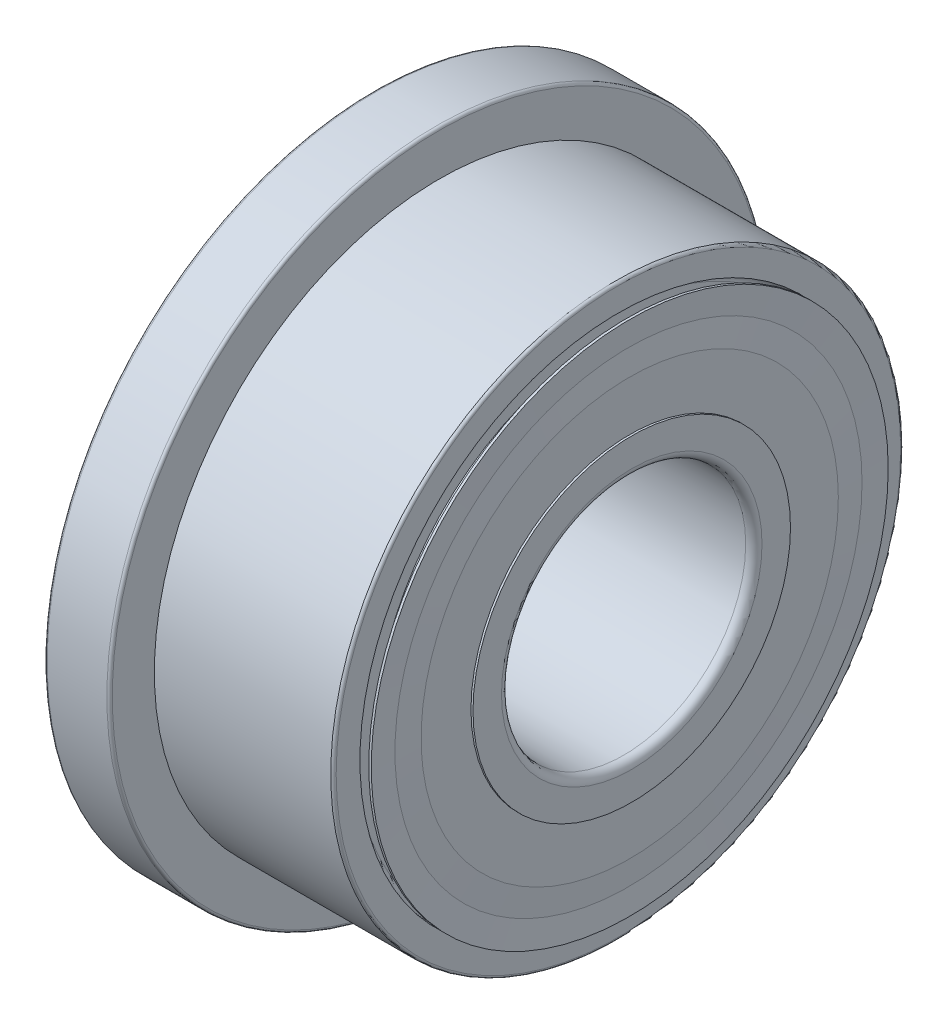
ISO-10303-21;
HEADER;
FILE_DESCRIPTION(('STEP AP214'),'2;1');
FILE_NAME('part.step','',(''),(''),'','','');
FILE_SCHEMA(('AUTOMOTIVE_DESIGN { 1 0 10303 214 1 1 1 1 }'));
ENDSEC;
DATA;
#1=APPLICATION_CONTEXT('core data for automotive mechanical design processes');
#2=APPLICATION_PROTOCOL_DEFINITION('international standard','automotive_design',2000,#1);
#3=PRODUCT_CONTEXT('',#1,'mechanical');
#4=PRODUCT('Part','Part','',(#3));
#5=PRODUCT_RELATED_PRODUCT_CATEGORY('part','',(#4));
#6=PRODUCT_DEFINITION_FORMATION('','',#4);
#7=PRODUCT_DEFINITION_CONTEXT('part definition',#1,'design');
#8=PRODUCT_DEFINITION('design','',#6,#7);
#9=PRODUCT_DEFINITION_SHAPE('','',#8);
#10=(LENGTH_UNIT() NAMED_UNIT(*) SI_UNIT(.MILLI.,.METRE.));
#11=(NAMED_UNIT(*) PLANE_ANGLE_UNIT() SI_UNIT($,.RADIAN.));
#12=(NAMED_UNIT(*) SI_UNIT($,.STERADIAN.) SOLID_ANGLE_UNIT());
#13=UNCERTAINTY_MEASURE_WITH_UNIT(LENGTH_MEASURE(1.E-05),#10,'distance_accuracy_value','');
#14=(GEOMETRIC_REPRESENTATION_CONTEXT(3) GLOBAL_UNCERTAINTY_ASSIGNED_CONTEXT((#13)) GLOBAL_UNIT_ASSIGNED_CONTEXT((#10,
#11,#12)) REPRESENTATION_CONTEXT('',''));
#15=CARTESIAN_POINT('',(0.,0.,0.));
#16=DIRECTION('',(0.,0.,1.));
#17=DIRECTION('',(1.,0.,0.));
#18=AXIS2_PLACEMENT_3D('',#15,#16,#17);
#19=CARTESIAN_POINT('',(2.36699999999871,0.,0.));
#20=DIRECTION('',(1.,0.,0.));
#21=DIRECTION('',(0.,0.,-1.));
#22=AXIS2_PLACEMENT_3D('',#19,#20,#21);
#23=CONICAL_SURFACE('',#22,1.905,1.4731486901);
#24=CARTESIAN_POINT('',(2.36699999999871,0.,0.));
#25=DIRECTION('',(1.,0.,0.));
#26=DIRECTION('',(0.,0.,-1.));
#27=AXIS2_PLACEMENT_3D('',#24,#25,#26);
#28=CIRCLE('',#27,1.905);
#29=CARTESIAN_POINT('',(2.36699999999871,0.,-1.905));
#30=VERTEX_POINT('',#29);
#31=EDGE_CURVE('E63',#30,#30,#28,.T.);
#32=ORIENTED_EDGE('',*,*,#31,.F.);
#33=EDGE_LOOP('',(#32));
#34=FACE_BOUND('',#33,.T.);
#35=CARTESIAN_POINT('',(2.34899999999872,0.,0.));
#36=DIRECTION('',(1.,0.,0.));
#37=DIRECTION('',(0.,0.,-1.));
#38=AXIS2_PLACEMENT_3D('',#35,#36,#37);
#39=CIRCLE('',#38,1.72125);
#40=CARTESIAN_POINT('',(2.34899999999872,0.,-1.72125));
#41=VERTEX_POINT('',#40);
#42=EDGE_CURVE('E12',#41,#41,#39,.T.);
#43=ORIENTED_EDGE('',*,*,#42,.T.);
#44=EDGE_LOOP('',(#43));
#45=FACE_BOUND('',#44,.T.);
#46=ADVANCED_FACE('F48',(#34,#45),#23,.T.);
#47=CARTESIAN_POINT('',(2.34899999999872,1.72125,0.));
#48=DIRECTION('',(-1.,0.,0.));
#49=DIRECTION('',(0.,0.,1.));
#50=AXIS2_PLACEMENT_3D('',#47,#48,#49);
#51=PLANE('',#50);
#52=ORIENTED_EDGE('',*,*,#42,.F.);
#53=EDGE_LOOP('',(#52));
#54=FACE_BOUND('',#53,.T.);
#55=CARTESIAN_POINT('',(2.34899999999872,0.,0.));
#56=DIRECTION('',(1.,0.,0.));
#57=DIRECTION('',(0.,0.,-1.));
#58=AXIS2_PLACEMENT_3D('',#55,#56,#57);
#59=CIRCLE('',#58,1.5375);
#60=CARTESIAN_POINT('',(2.34899999999872,0.,-1.5375));
#61=VERTEX_POINT('',#60);
#62=EDGE_CURVE('E57',#61,#61,#59,.T.);
#63=ORIENTED_EDGE('',*,*,#62,.T.);
#64=EDGE_LOOP('',(#63));
#65=FACE_BOUND('',#64,.T.);
#66=ADVANCED_FACE('F240',(#54,#65),#51,.T.);
#67=CARTESIAN_POINT('',(2.34899999999872,0.,0.));
#68=DIRECTION('',(-1.,0.,0.));
#69=DIRECTION('',(0.,0.,1.));
#70=AXIS2_PLACEMENT_3D('',#67,#68,#69);
#71=CONICAL_SURFACE('',#70,1.5375,1.521855846);
#72=ORIENTED_EDGE('',*,*,#62,.F.);
#73=EDGE_LOOP('',(#72));
#74=FACE_BOUND('',#73,.T.);
#75=CARTESIAN_POINT('',(2.36699631518965,0.,0.));
#76=DIRECTION('',(-1.,0.,0.));
#77=DIRECTION('',(0.,0.,1.));
#78=AXIS2_PLACEMENT_3D('',#75,#76,#77);
#79=CIRCLE('',#78,1.17007523154);
#80=CARTESIAN_POINT('',(2.36699631518965,0.,1.17007523151845));
#81=VERTEX_POINT('',#80);
#82=EDGE_CURVE('E151',#81,#81,#79,.T.);
#83=ORIENTED_EDGE('',*,*,#82,.F.);
#84=EDGE_LOOP('',(#83));
#85=FACE_BOUND('',#84,.T.);
#86=ADVANCED_FACE('F245',(#74,#85),#71,.F.);
#87=CARTESIAN_POINT('',(0.599999999998715,1.305,0.));
#88=DIRECTION('',(-1.,0.,0.));
#89=DIRECTION('',(0.,0.,1.));
#90=AXIS2_PLACEMENT_3D('',#87,#88,#89);
#91=PLANE('',#90);
#92=CARTESIAN_POINT('',(0.599999999998715,0.,0.));
#93=DIRECTION('',(1.,0.,0.));
#94=DIRECTION('',(0.,0.,-1.));
#95=AXIS2_PLACEMENT_3D('',#92,#93,#94);
#96=CIRCLE('',#95,1.17);
#97=CARTESIAN_POINT('',(0.599999999998715,0.,-1.17));
#98=VERTEX_POINT('',#97);
#99=EDGE_CURVE('E170',#98,#98,#96,.T.);
#100=ORIENTED_EDGE('',*,*,#99,.F.);
#101=EDGE_LOOP('',(#100));
#102=FACE_BOUND('',#101,.T.);
#103=CARTESIAN_POINT('',(0.599999999998715,0.,0.));
#104=DIRECTION('',(1.,0.,0.));
#105=DIRECTION('',(0.,0.,-1.));
#106=AXIS2_PLACEMENT_3D('',#103,#104,#105);
#107=CIRCLE('',#106,0.96);
#108=CARTESIAN_POINT('',(0.599999999998715,0.,-0.96));
#109=VERTEX_POINT('',#108);
#110=EDGE_CURVE('E180',#109,#109,#107,.T.);
#111=ORIENTED_EDGE('',*,*,#110,.T.);
#112=EDGE_LOOP('',(#111));
#113=FACE_BOUND('',#112,.T.);
#114=ADVANCED_FACE('F267',(#102,#113),#91,.T.);
#115=CARTESIAN_POINT('',(2.39999999999872,0.96,0.));
#116=DIRECTION('',(1.,0.,0.));
#117=DIRECTION('',(0.,1.,0.));
#118=AXIS2_PLACEMENT_3D('',#115,#116,#117);
#119=PLANE('',#118);
#120=CARTESIAN_POINT('',(2.39999999999872,0.,0.));
#121=DIRECTION('',(1.,0.,0.));
#122=DIRECTION('',(0.,0.,-1.));
#123=AXIS2_PLACEMENT_3D('',#120,#121,#122);
#124=CIRCLE('',#123,1.17);
#125=CARTESIAN_POINT('',(2.39999999999872,0.,-1.17));
#126=VERTEX_POINT('',#125);
#127=EDGE_CURVE('E172',#126,#126,#124,.T.);
#128=ORIENTED_EDGE('',*,*,#127,.T.);
#129=EDGE_LOOP('',(#128));
#130=FACE_BOUND('',#129,.T.);
#131=CARTESIAN_POINT('',(2.39999999999872,0.,0.));
#132=DIRECTION('',(1.,0.,0.));
#133=DIRECTION('',(0.,0.,-1.));
#134=AXIS2_PLACEMENT_3D('',#131,#132,#133);
#135=CIRCLE('',#134,0.96);
#136=CARTESIAN_POINT('',(2.39999999999872,0.,-0.96));
#137=VERTEX_POINT('',#136);
#138=EDGE_CURVE('E194',#137,#137,#135,.T.);
#139=ORIENTED_EDGE('',*,*,#138,.F.);
#140=EDGE_LOOP('',(#139));
#141=FACE_BOUND('',#140,.T.);
#142=ADVANCED_FACE('F263',(#130,#141),#119,.T.);
#143=CARTESIAN_POINT('',(1.49999999999872,0.,0.));
#144=DIRECTION('',(-1.,0.,0.));
#145=DIRECTION('',(0.,0.,-1.));
#146=AXIS2_PLACEMENT_3D('',#143,#144,#145);
#147=CYLINDRICAL_SURFACE('',#146,1.17);
#148=ORIENTED_EDGE('',*,*,#99,.T.);
#149=EDGE_LOOP('',(#148));
#150=FACE_BOUND('',#149,.T.);
#151=CARTESIAN_POINT('',(0.614999999998713,0.,0.));
#152=DIRECTION('',(1.,0.,0.));
#153=DIRECTION('',(0.,0.,-1.));
#154=AXIS2_PLACEMENT_3D('',#151,#152,#153);
#155=CIRCLE('',#154,1.17);
#156=CARTESIAN_POINT('',(0.614999999998713,0.,-1.17));
#157=VERTEX_POINT('',#156);
#158=EDGE_CURVE('E165',#157,#157,#155,.T.);
#159=ORIENTED_EDGE('',*,*,#158,.F.);
#160=EDGE_LOOP('',(#159));
#161=FACE_BOUND('',#160,.T.);
#162=ADVANCED_FACE('F266',(#150,#161),#147,.T.);
#163=CARTESIAN_POINT('',(0.629999999998715,0.,0.));
#164=DIRECTION('',(1.,0.,0.));
#165=DIRECTION('',(0.,0.,-1.));
#166=AXIS2_PLACEMENT_3D('',#163,#164,#165);
#167=TOROIDAL_SURFACE('',#166,1.23,0.06);
#168=CARTESIAN_POINT('',(0.633003684807782,0.,0.));
#169=DIRECTION('',(1.,0.,0.));
#170=DIRECTION('',(0.,0.,-1.));
#171=AXIS2_PLACEMENT_3D('',#168,#169,#170);
#172=CIRCLE('',#171,1.17007523154);
#173=CARTESIAN_POINT('',(0.633003684807782,0.,-1.17007523151845));
#174=VERTEX_POINT('',#173);
#175=EDGE_CURVE('E140',#174,#174,#172,.T.);
#176=ORIENTED_EDGE('',*,*,#175,.T.);
#177=EDGE_LOOP('',(#176));
#178=FACE_BOUND('',#177,.T.);
#179=CARTESIAN_POINT('',(0.689999999998715,0.,0.));
#180=DIRECTION('',(1.,0.,0.));
#181=DIRECTION('',(0.,0.,-1.));
#182=AXIS2_PLACEMENT_3D('',#179,#180,#181);
#183=CIRCLE('',#182,1.23);
#184=CARTESIAN_POINT('',(0.689999999998715,0.,-1.23));
#185=VERTEX_POINT('',#184);
#186=EDGE_CURVE('E144',#185,#185,#183,.T.);
#187=ORIENTED_EDGE('',*,*,#186,.F.);
#188=EDGE_LOOP('',(#187));
#189=FACE_BOUND('',#188,.T.);
#190=ADVANCED_FACE('F145',(#178,#189),#167,.F.);
#191=CARTESIAN_POINT('',(2.33999999999872,0.,0.));
#192=DIRECTION('',(1.,0.,0.));
#193=DIRECTION('',(0.,0.,-1.));
#194=AXIS2_PLACEMENT_3D('',#191,#192,#193);
#195=TOROIDAL_SURFACE('',#194,0.96,0.06);
#196=CARTESIAN_POINT('',(2.33999999999872,0.,0.));
#197=DIRECTION('',(1.,0.,0.));
#198=DIRECTION('',(0.,0.,-1.));
#199=AXIS2_PLACEMENT_3D('',#196,#197,#198);
#200=CIRCLE('',#199,0.9);
#201=CARTESIAN_POINT('',(2.33999999999872,0.,-0.9));
#202=VERTEX_POINT('',#201);
#203=EDGE_CURVE('E158',#202,#202,#200,.T.);
#204=ORIENTED_EDGE('',*,*,#203,.F.);
#205=EDGE_LOOP('',(#204));
#206=FACE_BOUND('',#205,.T.);
#207=ORIENTED_EDGE('',*,*,#138,.T.);
#208=EDGE_LOOP('',(#207));
#209=FACE_BOUND('',#208,.T.);
#210=ADVANCED_FACE('F256',(#206,#209),#195,.T.);
#211=CARTESIAN_POINT('',(1.49999999999872,0.,0.));
#212=DIRECTION('',(-1.,0.,0.));
#213=DIRECTION('',(0.,0.,-1.));
#214=AXIS2_PLACEMENT_3D('',#211,#212,#213);
#215=CYLINDRICAL_SURFACE('',#214,1.305);
#216=CARTESIAN_POINT('',(1.27201973769515,0.,0.));
#217=DIRECTION('',(1.,0.,0.));
#218=DIRECTION('',(0.,0.,-1.));
#219=AXIS2_PLACEMENT_3D('',#216,#217,#218);
#220=CIRCLE('',#219,1.305);
#221=CARTESIAN_POINT('',(1.27201973769515,0.,-1.305));
#222=VERTEX_POINT('',#221);
#223=EDGE_CURVE('E177',#222,#222,#220,.T.);
#224=ORIENTED_EDGE('',*,*,#223,.F.);
#225=EDGE_LOOP('',(#224));
#226=FACE_BOUND('',#225,.T.);
#227=CARTESIAN_POINT('',(0.689999999998715,0.,0.));
#228=DIRECTION('',(-1.,0.,0.));
#229=DIRECTION('',(0.,0.,-1.));
#230=AXIS2_PLACEMENT_3D('',#227,#228,#229);
#231=CIRCLE('',#230,1.305);
#232=CARTESIAN_POINT('',(0.689999999998715,0.,-1.305));
#233=VERTEX_POINT('',#232);
#234=EDGE_CURVE('E147',#233,#233,#231,.T.);
#235=ORIENTED_EDGE('',*,*,#234,.F.);
#236=EDGE_LOOP('',(#235));
#237=FACE_BOUND('',#236,.T.);
#238=ADVANCED_FACE('F252',(#226,#237),#215,.T.);
#239=CARTESIAN_POINT('',(1.49999999999872,0.,0.));
#240=DIRECTION('',(1.,0.,0.));
#241=DIRECTION('',(0.,0.,-1.));
#242=AXIS2_PLACEMENT_3D('',#239,#240,#241);
#243=TOROIDAL_SURFACE('',#242,1.5,0.3);
#244=ORIENTED_EDGE('',*,*,#223,.T.);
#245=EDGE_LOOP('',(#244));
#246=FACE_BOUND('',#245,.T.);
#247=CARTESIAN_POINT('',(1.72798026230228,0.,0.));
#248=DIRECTION('',(1.,0.,0.));
#249=DIRECTION('',(0.,0.,-1.));
#250=AXIS2_PLACEMENT_3D('',#247,#248,#249);
#251=CIRCLE('',#250,1.305);
#252=CARTESIAN_POINT('',(1.72798026230228,0.,-1.305));
#253=VERTEX_POINT('',#252);
#254=EDGE_CURVE('E174',#253,#253,#251,.T.);
#255=ORIENTED_EDGE('',*,*,#254,.F.);
#256=EDGE_LOOP('',(#255));
#257=FACE_BOUND('',#256,.T.);
#258=ADVANCED_FACE('F255',(#246,#257),#243,.F.);
#259=CARTESIAN_POINT('',(1.49999999999872,0.,0.));
#260=DIRECTION('',(-1.,0.,0.));
#261=DIRECTION('',(0.,0.,-1.));
#262=AXIS2_PLACEMENT_3D('',#259,#260,#261);
#263=CYLINDRICAL_SURFACE('',#262,1.305);
#264=CARTESIAN_POINT('',(2.30999999999871,0.,0.));
#265=DIRECTION('',(1.,0.,0.));
#266=DIRECTION('',(0.,0.,1.));
#267=AXIS2_PLACEMENT_3D('',#264,#265,#266);
#268=CIRCLE('',#267,1.305);
#269=CARTESIAN_POINT('',(2.30999999999871,0.,1.305));
#270=VERTEX_POINT('',#269);
#271=EDGE_CURVE('E198',#270,#270,#268,.T.);
#272=ORIENTED_EDGE('',*,*,#271,.F.);
#273=EDGE_LOOP('',(#272));
#274=FACE_BOUND('',#273,.T.);
#275=ORIENTED_EDGE('',*,*,#254,.T.);
#276=EDGE_LOOP('',(#275));
#277=FACE_BOUND('',#276,.T.);
#278=ADVANCED_FACE('F296',(#274,#277),#263,.T.);
#279=CARTESIAN_POINT('',(1.49999999999872,0.,0.));
#280=DIRECTION('',(-1.,0.,0.));
#281=DIRECTION('',(0.,0.,-1.));
#282=AXIS2_PLACEMENT_3D('',#279,#280,#281);
#283=CYLINDRICAL_SURFACE('',#282,0.9);
#284=CARTESIAN_POINT('',(0.659999999998715,0.,0.));
#285=DIRECTION('',(1.,0.,0.));
#286=DIRECTION('',(0.,0.,-1.));
#287=AXIS2_PLACEMENT_3D('',#284,#285,#286);
#288=CIRCLE('',#287,0.9);
#289=CARTESIAN_POINT('',(0.659999999998715,0.,-0.9));
#290=VERTEX_POINT('',#289);
#291=EDGE_CURVE('E181',#290,#290,#288,.T.);
#292=ORIENTED_EDGE('',*,*,#291,.F.);
#293=EDGE_LOOP('',(#292));
#294=FACE_BOUND('',#293,.T.);
#295=ORIENTED_EDGE('',*,*,#203,.T.);
#296=EDGE_LOOP('',(#295));
#297=FACE_BOUND('',#296,.T.);
#298=ADVANCED_FACE('F284',(#294,#297),#283,.F.);
#299=CARTESIAN_POINT('',(0.659999999998715,0.,0.));
#300=DIRECTION('',(1.,0.,0.));
#301=DIRECTION('',(0.,0.,-1.));
#302=AXIS2_PLACEMENT_3D('',#299,#300,#301);
#303=TOROIDAL_SURFACE('',#302,0.96,0.06);
#304=ORIENTED_EDGE('',*,*,#110,.F.);
#305=EDGE_LOOP('',(#304));
#306=FACE_BOUND('',#305,.T.);
#307=ORIENTED_EDGE('',*,*,#291,.T.);
#308=EDGE_LOOP('',(#307));
#309=FACE_BOUND('',#308,.T.);
#310=ADVANCED_FACE('F280',(#306,#309),#303,.T.);
#311=CARTESIAN_POINT('',(1.49999999999872,0.,0.));
#312=DIRECTION('',(-1.,0.,0.));
#313=DIRECTION('',(0.,0.,-1.));
#314=AXIS2_PLACEMENT_3D('',#311,#312,#313);
#315=CYLINDRICAL_SURFACE('',#314,1.17);
#316=CARTESIAN_POINT('',(2.38499999999872,0.,0.));
#317=DIRECTION('',(1.,0.,0.));
#318=DIRECTION('',(0.,0.,-1.));
#319=AXIS2_PLACEMENT_3D('',#316,#317,#318);
#320=CIRCLE('',#319,1.17);
#321=CARTESIAN_POINT('',(2.38499999999872,0.,-1.17));
#322=VERTEX_POINT('',#321);
#323=EDGE_CURVE('E184',#322,#322,#320,.T.);
#324=ORIENTED_EDGE('',*,*,#323,.T.);
#325=EDGE_LOOP('',(#324));
#326=FACE_BOUND('',#325,.T.);
#327=ORIENTED_EDGE('',*,*,#127,.F.);
#328=EDGE_LOOP('',(#327));
#329=FACE_BOUND('',#328,.T.);
#330=ADVANCED_FACE('F277',(#326,#329),#315,.T.);
#331=CARTESIAN_POINT('',(2.30999999999871,1.86,0.));
#332=DIRECTION('',(-1.,0.,0.));
#333=DIRECTION('',(0.,0.,1.));
#334=AXIS2_PLACEMENT_3D('',#331,#332,#333);
#335=PLANE('',#334);
#336=ORIENTED_EDGE('',*,*,#271,.T.);
#337=EDGE_LOOP('',(#336));
#338=FACE_BOUND('',#337,.T.);
#339=CARTESIAN_POINT('',(2.30999999999871,0.,0.));
#340=DIRECTION('',(1.,0.,0.));
#341=DIRECTION('',(0.,0.,-1.));
#342=AXIS2_PLACEMENT_3D('',#339,#340,#341);
#343=CIRCLE('',#342,1.23);
#344=CARTESIAN_POINT('',(2.30999999999871,0.,-1.23));
#345=VERTEX_POINT('',#344);
#346=EDGE_CURVE('E195',#345,#345,#343,.T.);
#347=ORIENTED_EDGE('',*,*,#346,.F.);
#348=EDGE_LOOP('',(#347));
#349=FACE_BOUND('',#348,.T.);
#350=ADVANCED_FACE('F274',(#338,#349),#335,.F.);
#351=CARTESIAN_POINT('',(2.36999999999871,0.,0.));
#352=DIRECTION('',(1.,0.,0.));
#353=DIRECTION('',(0.,0.,-1.));
#354=AXIS2_PLACEMENT_3D('',#351,#352,#353);
#355=TOROIDAL_SURFACE('',#354,1.23,0.06);
#356=ORIENTED_EDGE('',*,*,#346,.T.);
#357=EDGE_LOOP('',(#356));
#358=FACE_BOUND('',#357,.T.);
#359=ORIENTED_EDGE('',*,*,#82,.T.);
#360=EDGE_LOOP('',(#359));
#361=FACE_BOUND('',#360,.T.);
#362=ADVANCED_FACE('F272',(#358,#361),#355,.F.);
#363=CARTESIAN_POINT('',(0.689999999998715,1.23,0.));
#364=DIRECTION('',(1.,0.,0.));
#365=DIRECTION('',(0.,1.,0.));
#366=AXIS2_PLACEMENT_3D('',#363,#364,#365);
#367=PLANE('',#366);
#368=ORIENTED_EDGE('',*,*,#234,.T.);
#369=EDGE_LOOP('',(#368));
#370=FACE_BOUND('',#369,.T.);
#371=ORIENTED_EDGE('',*,*,#186,.T.);
#372=EDGE_LOOP('',(#371));
#373=FACE_BOUND('',#372,.T.);
#374=ADVANCED_FACE('F50',(#370,#373),#367,.F.);
#375=CARTESIAN_POINT('',(30.5999999999987,0.,0.));
#376=DIRECTION('',(-1.,0.,0.));
#377=DIRECTION('',(0.,0.,-1.));
#378=AXIS2_PLACEMENT_3D('',#375,#376,#377);
#379=CYLINDRICAL_SURFACE('',#378,1.905);
#380=CARTESIAN_POINT('',(0.632999999998715,0.,0.));
#381=DIRECTION('',(1.,0.,0.));
#382=DIRECTION('',(0.,0.,-1.));
#383=AXIS2_PLACEMENT_3D('',#380,#381,#382);
#384=CIRCLE('',#383,1.905);
#385=CARTESIAN_POINT('',(0.632999999998715,0.,-1.905));
#386=VERTEX_POINT('',#385);
#387=EDGE_CURVE('E163',#386,#386,#384,.T.);
#388=ORIENTED_EDGE('',*,*,#387,.F.);
#389=EDGE_LOOP('',(#388));
#390=FACE_BOUND('',#389,.T.);
#391=CARTESIAN_POINT('',(0.614999999998713,0.,0.));
#392=DIRECTION('',(1.,0.,0.));
#393=DIRECTION('',(0.,0.,-1.));
#394=AXIS2_PLACEMENT_3D('',#391,#392,#393);
#395=CIRCLE('',#394,1.905);
#396=CARTESIAN_POINT('',(0.614999999998713,0.,-1.905));
#397=VERTEX_POINT('',#396);
#398=EDGE_CURVE('E148',#397,#397,#395,.T.);
#399=ORIENTED_EDGE('',*,*,#398,.T.);
#400=EDGE_LOOP('',(#399));
#401=FACE_BOUND('',#400,.T.);
#402=ADVANCED_FACE('F304',(#390,#401),#379,.T.);
#403=CARTESIAN_POINT('',(0.614999999998713,0.,0.));
#404=DIRECTION('',(-1.,0.,0.));
#405=DIRECTION('',(0.,0.,1.));
#406=AXIS2_PLACEMENT_3D('',#403,#404,#405);
#407=CONICAL_SURFACE('',#406,1.905,1.521855846);
#408=ORIENTED_EDGE('',*,*,#398,.F.);
#409=EDGE_LOOP('',(#408));
#410=FACE_BOUND('',#409,.T.);
#411=CARTESIAN_POINT('',(0.623999999998714,0.,0.));
#412=DIRECTION('',(1.,0.,0.));
#413=DIRECTION('',(0.,0.,-1.));
#414=AXIS2_PLACEMENT_3D('',#411,#412,#413);
#415=CIRCLE('',#414,1.72125);
#416=CARTESIAN_POINT('',(0.623999999998714,0.,-1.72125));
#417=VERTEX_POINT('',#416);
#418=EDGE_CURVE('E154',#417,#417,#415,.T.);
#419=ORIENTED_EDGE('',*,*,#418,.T.);
#420=EDGE_LOOP('',(#419));
#421=FACE_BOUND('',#420,.T.);
#422=ADVANCED_FACE('F261',(#410,#421),#407,.F.);
#423=CARTESIAN_POINT('',(0.623999999998714,0.,0.));
#424=DIRECTION('',(1.,0.,0.));
#425=DIRECTION('',(0.,0.,-1.));
#426=AXIS2_PLACEMENT_3D('',#423,#424,#425);
#427=CONICAL_SURFACE('',#426,1.72125,1.521855846);
#428=ORIENTED_EDGE('',*,*,#418,.F.);
#429=EDGE_LOOP('',(#428));
#430=FACE_BOUND('',#429,.T.);
#431=CARTESIAN_POINT('',(0.614999999998713,0.,0.));
#432=DIRECTION('',(1.,0.,0.));
#433=DIRECTION('',(0.,0.,-1.));
#434=AXIS2_PLACEMENT_3D('',#431,#432,#433);
#435=CIRCLE('',#434,1.5375);
#436=CARTESIAN_POINT('',(0.614999999998713,0.,-1.5375));
#437=VERTEX_POINT('',#436);
#438=EDGE_CURVE('E168',#437,#437,#435,.T.);
#439=ORIENTED_EDGE('',*,*,#438,.T.);
#440=EDGE_LOOP('',(#439));
#441=FACE_BOUND('',#440,.T.);
#442=ADVANCED_FACE('F258',(#430,#441),#427,.T.);
#443=CARTESIAN_POINT('',(0.614999999998715,1.5375,0.));
#444=DIRECTION('',(-1.,0.,0.));
#445=DIRECTION('',(0.,0.,1.));
#446=AXIS2_PLACEMENT_3D('',#443,#444,#445);
#447=PLANE('',#446);
#448=ORIENTED_EDGE('',*,*,#438,.F.);
#449=EDGE_LOOP('',(#448));
#450=FACE_BOUND('',#449,.T.);
#451=ORIENTED_EDGE('',*,*,#158,.T.);
#452=EDGE_LOOP('',(#451));
#453=FACE_BOUND('',#452,.T.);
#454=ADVANCED_FACE('F236',(#450,#453),#447,.T.);
#455=CARTESIAN_POINT('',(0.632999999998715,0.,0.));
#456=DIRECTION('',(1.,0.,0.));
#457=DIRECTION('',(0.,0.,-1.));
#458=AXIS2_PLACEMENT_3D('',#455,#456,#457);
#459=CONICAL_SURFACE('',#458,1.17,1.521855846);
#460=CARTESIAN_POINT('',(0.650999999998716,0.,0.));
#461=DIRECTION('',(1.,0.,0.));
#462=DIRECTION('',(0.,0.,-1.));
#463=AXIS2_PLACEMENT_3D('',#460,#461,#462);
#464=CIRCLE('',#463,1.5375);
#465=CARTESIAN_POINT('',(0.650999999998716,0.,-1.5375));
#466=VERTEX_POINT('',#465);
#467=EDGE_CURVE('E169',#466,#466,#464,.T.);
#468=ORIENTED_EDGE('',*,*,#467,.T.);
#469=EDGE_LOOP('',(#468));
#470=FACE_BOUND('',#469,.T.);
#471=ORIENTED_EDGE('',*,*,#175,.F.);
#472=EDGE_LOOP('',(#471));
#473=FACE_BOUND('',#472,.T.);
#474=ADVANCED_FACE('F222',(#470,#473),#459,.F.);
#475=CARTESIAN_POINT('',(0.650999999998715,1.5375,0.));
#476=DIRECTION('',(1.,0.,0.));
#477=DIRECTION('',(0.,1.,0.));
#478=AXIS2_PLACEMENT_3D('',#475,#476,#477);
#479=PLANE('',#478);
#480=CARTESIAN_POINT('',(0.650999999998716,0.,0.));
#481=DIRECTION('',(1.,0.,0.));
#482=DIRECTION('',(0.,0.,-1.));
#483=AXIS2_PLACEMENT_3D('',#480,#481,#482);
#484=CIRCLE('',#483,1.72125);
#485=CARTESIAN_POINT('',(0.650999999998716,0.,-1.72125));
#486=VERTEX_POINT('',#485);
#487=EDGE_CURVE('E187',#486,#486,#484,.T.);
#488=ORIENTED_EDGE('',*,*,#487,.T.);
#489=EDGE_LOOP('',(#488));
#490=FACE_BOUND('',#489,.T.);
#491=ORIENTED_EDGE('',*,*,#467,.F.);
#492=EDGE_LOOP('',(#491));
#493=FACE_BOUND('',#492,.T.);
#494=ADVANCED_FACE('F224',(#490,#493),#479,.T.);
#495=CARTESIAN_POINT('',(0.650999999998716,0.,0.));
#496=DIRECTION('',(-1.,0.,0.));
#497=DIRECTION('',(0.,0.,1.));
#498=AXIS2_PLACEMENT_3D('',#495,#496,#497);
#499=CONICAL_SURFACE('',#498,1.72125,1.4731486901);
#500=ORIENTED_EDGE('',*,*,#387,.T.);
#501=EDGE_LOOP('',(#500));
#502=FACE_BOUND('',#501,.T.);
#503=ORIENTED_EDGE('',*,*,#487,.F.);
#504=EDGE_LOOP('',(#503));
#505=FACE_BOUND('',#504,.T.);
#506=ADVANCED_FACE('F226',(#502,#505),#499,.T.);
#507=CARTESIAN_POINT('',(2.38499999999872,1.17,0.));
#508=DIRECTION('',(1.,0.,0.));
#509=DIRECTION('',(0.,1.,0.));
#510=AXIS2_PLACEMENT_3D('',#507,#508,#509);
#511=PLANE('',#510);
#512=CARTESIAN_POINT('',(2.38499999999872,0.,0.));
#513=DIRECTION('',(1.,0.,0.));
#514=DIRECTION('',(0.,0.,-1.));
#515=AXIS2_PLACEMENT_3D('',#512,#513,#514);
#516=CIRCLE('',#515,1.5375);
#517=CARTESIAN_POINT('',(2.38499999999872,0.,-1.5375));
#518=VERTEX_POINT('',#517);
#519=EDGE_CURVE('E160',#518,#518,#516,.T.);
#520=ORIENTED_EDGE('',*,*,#519,.T.);
#521=EDGE_LOOP('',(#520));
#522=FACE_BOUND('',#521,.T.);
#523=ORIENTED_EDGE('',*,*,#323,.F.);
#524=EDGE_LOOP('',(#523));
#525=FACE_BOUND('',#524,.T.);
#526=ADVANCED_FACE('F233',(#522,#525),#511,.T.);
#527=CARTESIAN_POINT('',(2.38499999999872,0.,0.));
#528=DIRECTION('',(-1.,0.,0.));
#529=DIRECTION('',(0.,0.,1.));
#530=AXIS2_PLACEMENT_3D('',#527,#528,#529);
#531=CONICAL_SURFACE('',#530,1.5375,1.521855846);
#532=CARTESIAN_POINT('',(2.37599999999872,0.,0.));
#533=DIRECTION('',(1.,0.,0.));
#534=DIRECTION('',(0.,0.,-1.));
#535=AXIS2_PLACEMENT_3D('',#532,#533,#534);
#536=CIRCLE('',#535,1.72125);
#537=CARTESIAN_POINT('',(2.37599999999872,0.,-1.72125));
#538=VERTEX_POINT('',#537);
#539=EDGE_CURVE('E164',#538,#538,#536,.T.);
#540=ORIENTED_EDGE('',*,*,#539,.T.);
#541=EDGE_LOOP('',(#540));
#542=FACE_BOUND('',#541,.T.);
#543=ORIENTED_EDGE('',*,*,#519,.F.);
#544=EDGE_LOOP('',(#543));
#545=FACE_BOUND('',#544,.T.);
#546=ADVANCED_FACE('F289',(#542,#545),#531,.T.);
#547=CARTESIAN_POINT('',(2.37599999999872,0.,0.));
#548=DIRECTION('',(1.,0.,0.));
#549=DIRECTION('',(0.,0.,-1.));
#550=AXIS2_PLACEMENT_3D('',#547,#548,#549);
#551=CONICAL_SURFACE('',#550,1.72125,1.521855846);
#552=CARTESIAN_POINT('',(2.38499999999872,0.,0.));
#553=DIRECTION('',(1.,0.,0.));
#554=DIRECTION('',(0.,0.,-1.));
#555=AXIS2_PLACEMENT_3D('',#552,#553,#554);
#556=CIRCLE('',#555,1.905);
#557=CARTESIAN_POINT('',(2.38499999999872,0.,-1.905));
#558=VERTEX_POINT('',#557);
#559=EDGE_CURVE('E206',#558,#558,#556,.T.);
#560=ORIENTED_EDGE('',*,*,#559,.T.);
#561=EDGE_LOOP('',(#560));
#562=FACE_BOUND('',#561,.T.);
#563=ORIENTED_EDGE('',*,*,#539,.F.);
#564=EDGE_LOOP('',(#563));
#565=FACE_BOUND('',#564,.T.);
#566=ADVANCED_FACE('F292',(#562,#565),#551,.F.);
#567=CARTESIAN_POINT('',(30.5999999999987,0.,0.));
#568=DIRECTION('',(-1.,0.,0.));
#569=DIRECTION('',(0.,0.,-1.));
#570=AXIS2_PLACEMENT_3D('',#567,#568,#569);
#571=CYLINDRICAL_SURFACE('',#570,1.905);
#572=ORIENTED_EDGE('',*,*,#559,.F.);
#573=EDGE_LOOP('',(#572));
#574=FACE_BOUND('',#573,.T.);
#575=ORIENTED_EDGE('',*,*,#31,.T.);
#576=EDGE_LOOP('',(#575));
#577=FACE_BOUND('',#576,.T.);
#578=ADVANCED_FACE('F251',(#574,#577),#571,.T.);
#579=CLOSED_SHELL('',(#46,#66,#86,#114,#142,#162,#190,#210,#238,#258,#278,#298,#310,#330,#350,
#362,#374,#402,#422,#442,#454,#474,#494,#506,#526,#546,#566,#578));
#580=MANIFOLD_SOLID_BREP('B2',#579);
#581=CARTESIAN_POINT('',(0.521793917795855,0.,0.));
#582=DIRECTION('',(1.,0.,0.));
#583=DIRECTION('',(0.,0.,-1.));
#584=AXIS2_PLACEMENT_3D('',#581,#582,#583);
#585=TOROIDAL_SURFACE('',#584,2.41000000002,0.01999999998);
#586=CARTESIAN_POINT('',(0.521793917795857,0.,0.));
#587=DIRECTION('',(1.,0.,0.));
#588=DIRECTION('',(0.,0.,-1.));
#589=AXIS2_PLACEMENT_3D('',#586,#587,#588);
#590=CIRCLE('',#589,2.43);
#591=CARTESIAN_POINT('',(0.521793917795857,0.,-2.43));
#592=VERTEX_POINT('',#591);
#593=EDGE_CURVE('E562',#592,#592,#590,.T.);
#594=ORIENTED_EDGE('',*,*,#593,.F.);
#595=EDGE_LOOP('',(#594));
#596=FACE_BOUND('',#595,.T.);
#597=CARTESIAN_POINT('',(0.501793917795855,0.,0.));
#598=DIRECTION('',(1.,0.,0.));
#599=DIRECTION('',(0.,0.,-1.));
#600=AXIS2_PLACEMENT_3D('',#597,#598,#599);
#601=CIRCLE('',#600,2.41000000002);
#602=CARTESIAN_POINT('',(0.501793917795855,0.,-2.41));
#603=VERTEX_POINT('',#602);
#604=EDGE_CURVE('E46',#603,#603,#601,.T.);
#605=ORIENTED_EDGE('',*,*,#604,.T.);
#606=EDGE_LOOP('',(#605));
#607=FACE_BOUND('',#606,.T.);
#608=ADVANCED_FACE('F545',(#596,#607),#585,.T.);
#609=CARTESIAN_POINT('',(0.501793917795855,2.41,0.));
#610=DIRECTION('',(-1.,0.,0.));
#611=DIRECTION('',(0.,0.,1.));
#612=AXIS2_PLACEMENT_3D('',#609,#610,#611);
#613=PLANE('',#612);
#614=ORIENTED_EDGE('',*,*,#604,.F.);
#615=EDGE_LOOP('',(#614));
#616=FACE_BOUND('',#615,.T.);
#617=CARTESIAN_POINT('',(0.501793917795855,0.,0.));
#618=DIRECTION('',(1.,0.,0.));
#619=DIRECTION('',(0.,0.,-1.));
#620=AXIS2_PLACEMENT_3D('',#617,#618,#619);
#621=CIRCLE('',#620,1.905);
#622=CARTESIAN_POINT('',(0.501793917795855,0.,-1.905));
#623=VERTEX_POINT('',#622);
#624=EDGE_CURVE('E555',#623,#623,#621,.T.);
#625=ORIENTED_EDGE('',*,*,#624,.T.);
#626=EDGE_LOOP('',(#625));
#627=FACE_BOUND('',#626,.T.);
#628=ADVANCED_FACE('F674',(#616,#627),#613,.T.);
#629=CARTESIAN_POINT('',(30.5017939177959,0.,0.));
#630=DIRECTION('',(-1.,0.,0.));
#631=DIRECTION('',(0.,0.,-1.));
#632=AXIS2_PLACEMENT_3D('',#629,#630,#631);
#633=CYLINDRICAL_SURFACE('',#632,1.905);
#634=ORIENTED_EDGE('',*,*,#624,.F.);
#635=EDGE_LOOP('',(#634));
#636=FACE_BOUND('',#635,.T.);
#637=CARTESIAN_POINT('',(0.531793917795856,0.,0.));
#638=DIRECTION('',(1.,0.,0.));
#639=DIRECTION('',(0.,0.,-1.));
#640=AXIS2_PLACEMENT_3D('',#637,#638,#639);
#641=CIRCLE('',#640,1.905);
#642=CARTESIAN_POINT('',(0.531793917795856,0.,-1.905));
#643=VERTEX_POINT('',#642);
#644=EDGE_CURVE('E846',#643,#643,#641,.T.);
#645=ORIENTED_EDGE('',*,*,#644,.T.);
#646=EDGE_LOOP('',(#645));
#647=FACE_BOUND('',#646,.T.);
#648=ADVANCED_FACE('F678',(#636,#647),#633,.F.);
#649=CARTESIAN_POINT('',(0.531793917795856,0.,0.));
#650=DIRECTION('',(1.,0.,0.));
#651=DIRECTION('',(0.,0.,-1.));
#652=AXIS2_PLACEMENT_3D('',#649,#650,#651);
#653=TOROIDAL_SURFACE('',#652,1.845,0.06);
#654=CARTESIAN_POINT('',(0.591793917795854,0.,0.));
#655=DIRECTION('',(1.,0.,0.));
#656=DIRECTION('',(0.,0.,-1.));
#657=AXIS2_PLACEMENT_3D('',#654,#655,#656);
#658=CIRCLE('',#657,1.845);
#659=CARTESIAN_POINT('',(0.591793917795854,0.,-1.845));
#660=VERTEX_POINT('',#659);
#661=EDGE_CURVE('E588',#660,#660,#658,.T.);
#662=ORIENTED_EDGE('',*,*,#661,.T.);
#663=EDGE_LOOP('',(#662));
#664=FACE_BOUND('',#663,.T.);
#665=ORIENTED_EDGE('',*,*,#644,.F.);
#666=EDGE_LOOP('',(#665));
#667=FACE_BOUND('',#666,.T.);
#668=ADVANCED_FACE('F683',(#664,#667),#653,.F.);
#669=CARTESIAN_POINT('',(0.591793917795855,1.845,0.));
#670=DIRECTION('',(-1.,0.,0.));
#671=DIRECTION('',(0.,0.,1.));
#672=AXIS2_PLACEMENT_3D('',#669,#670,#671);
#673=PLANE('',#672);
#674=ORIENTED_EDGE('',*,*,#661,.F.);
#675=EDGE_LOOP('',(#674));
#676=FACE_BOUND('',#675,.T.);
#677=CARTESIAN_POINT('',(0.591793917795854,0.,0.));
#678=DIRECTION('',(1.,0.,0.));
#679=DIRECTION('',(0.,0.,-1.));
#680=AXIS2_PLACEMENT_3D('',#677,#678,#679);
#681=CIRCLE('',#680,1.701);
#682=CARTESIAN_POINT('',(0.591793917795854,0.,-1.701));
#683=VERTEX_POINT('',#682);
#684=EDGE_CURVE('E595',#683,#683,#681,.T.);
#685=ORIENTED_EDGE('',*,*,#684,.T.);
#686=EDGE_LOOP('',(#685));
#687=FACE_BOUND('',#686,.T.);
#688=ADVANCED_FACE('F686',(#676,#687),#673,.T.);
#689=CARTESIAN_POINT('',(30.5017939177959,0.,0.));
#690=DIRECTION('',(-1.,0.,0.));
#691=DIRECTION('',(0.,0.,-1.));
#692=AXIS2_PLACEMENT_3D('',#689,#690,#691);
#693=CYLINDRICAL_SURFACE('',#692,1.701);
#694=ORIENTED_EDGE('',*,*,#684,.F.);
#695=EDGE_LOOP('',(#694));
#696=FACE_BOUND('',#695,.T.);
#697=CARTESIAN_POINT('',(1.17908558836025,0.,0.));
#698=DIRECTION('',(1.,0.,0.));
#699=DIRECTION('',(0.,0.,-1.));
#700=AXIS2_PLACEMENT_3D('',#697,#698,#699);
#701=CIRCLE('',#700,1.701);
#702=CARTESIAN_POINT('',(1.17908558836025,0.,-1.701));
#703=VERTEX_POINT('',#702);
#704=EDGE_CURVE('E638',#703,#703,#701,.T.);
#705=ORIENTED_EDGE('',*,*,#704,.T.);
#706=EDGE_LOOP('',(#705));
#707=FACE_BOUND('',#706,.T.);
#708=ADVANCED_FACE('F718',(#696,#707),#693,.F.);
#709=CARTESIAN_POINT('',(1.40179391779586,0.,0.));
#710=DIRECTION('',(1.,0.,0.));
#711=DIRECTION('',(0.,0.,-1.));
#712=AXIS2_PLACEMENT_3D('',#709,#710,#711);
#713=TOROIDAL_SURFACE('',#712,1.5,0.3);
#714=CARTESIAN_POINT('',(1.62450224723147,0.,0.));
#715=DIRECTION('',(1.,0.,0.));
#716=DIRECTION('',(0.,0.,-1.));
#717=AXIS2_PLACEMENT_3D('',#714,#715,#716);
#718=CIRCLE('',#717,1.701);
#719=CARTESIAN_POINT('',(1.62450224723147,0.,-1.701));
#720=VERTEX_POINT('',#719);
#721=EDGE_CURVE('E635',#720,#720,#718,.T.);
#722=ORIENTED_EDGE('',*,*,#721,.T.);
#723=EDGE_LOOP('',(#722));
#724=FACE_BOUND('',#723,.T.);
#725=ORIENTED_EDGE('',*,*,#704,.F.);
#726=EDGE_LOOP('',(#725));
#727=FACE_BOUND('',#726,.T.);
#728=CARTESIAN_POINT('',(1.40179391779586,0.,-1.8));
#729=VERTEX_POINT('',#728);
#730=VERTEX_LOOP('',#729);
#731=FACE_BOUND('',#730,.T.);
#732=ADVANCED_FACE('F700',(#724,#727,#731),#713,.F.);
#733=CARTESIAN_POINT('',(30.5017939177959,0.,0.));
#734=DIRECTION('',(-1.,0.,0.));
#735=DIRECTION('',(0.,0.,-1.));
#736=AXIS2_PLACEMENT_3D('',#733,#734,#735);
#737=CYLINDRICAL_SURFACE('',#736,1.701);
#738=ORIENTED_EDGE('',*,*,#721,.F.);
#739=EDGE_LOOP('',(#738));
#740=FACE_BOUND('',#739,.T.);
#741=CARTESIAN_POINT('',(2.21179391779586,0.,0.));
#742=DIRECTION('',(1.,0.,0.));
#743=DIRECTION('',(0.,0.,-1.));
#744=AXIS2_PLACEMENT_3D('',#741,#742,#743);
#745=CIRCLE('',#744,1.701);
#746=CARTESIAN_POINT('',(2.21179391779586,0.,-1.701));
#747=VERTEX_POINT('',#746);
#748=EDGE_CURVE('E639',#747,#747,#745,.T.);
#749=ORIENTED_EDGE('',*,*,#748,.T.);
#750=EDGE_LOOP('',(#749));
#751=FACE_BOUND('',#750,.T.);
#752=ADVANCED_FACE('F697',(#740,#751),#737,.F.);
#753=CARTESIAN_POINT('',(2.21179391779586,1.701,0.));
#754=DIRECTION('',(1.,0.,0.));
#755=DIRECTION('',(0.,1.,0.));
#756=AXIS2_PLACEMENT_3D('',#753,#754,#755);
#757=PLANE('',#756);
#758=CARTESIAN_POINT('',(2.21179391779586,0.,0.));
#759=DIRECTION('',(1.,0.,0.));
#760=DIRECTION('',(0.,0.,-1.));
#761=AXIS2_PLACEMENT_3D('',#758,#759,#760);
#762=CIRCLE('',#761,1.845);
#763=CARTESIAN_POINT('',(2.21179391779586,0.,-1.845));
#764=VERTEX_POINT('',#763);
#765=EDGE_CURVE('E628',#764,#764,#762,.T.);
#766=ORIENTED_EDGE('',*,*,#765,.T.);
#767=EDGE_LOOP('',(#766));
#768=FACE_BOUND('',#767,.T.);
#769=ORIENTED_EDGE('',*,*,#748,.F.);
#770=EDGE_LOOP('',(#769));
#771=FACE_BOUND('',#770,.T.);
#772=ADVANCED_FACE('F695',(#768,#771),#757,.T.);
#773=CARTESIAN_POINT('',(2.27179391779586,0.,0.));
#774=DIRECTION('',(1.,0.,0.));
#775=DIRECTION('',(0.,0.,-1.));
#776=AXIS2_PLACEMENT_3D('',#773,#774,#775);
#777=TOROIDAL_SURFACE('',#776,1.845,0.06);
#778=CARTESIAN_POINT('',(2.27179391779586,0.,0.));
#779=DIRECTION('',(1.,0.,0.));
#780=DIRECTION('',(0.,0.,-1.));
#781=AXIS2_PLACEMENT_3D('',#778,#779,#780);
#782=CIRCLE('',#781,1.905);
#783=CARTESIAN_POINT('',(2.27179391779586,0.,-1.905));
#784=VERTEX_POINT('',#783);
#785=EDGE_CURVE('E633',#784,#784,#782,.T.);
#786=ORIENTED_EDGE('',*,*,#785,.T.);
#787=EDGE_LOOP('',(#786));
#788=FACE_BOUND('',#787,.T.);
#789=ORIENTED_EDGE('',*,*,#765,.F.);
#790=EDGE_LOOP('',(#789));
#791=FACE_BOUND('',#790,.T.);
#792=ADVANCED_FACE('F691',(#788,#791),#777,.F.);
#793=CARTESIAN_POINT('',(30.5017939177959,0.,0.));
#794=DIRECTION('',(-1.,0.,0.));
#795=DIRECTION('',(0.,0.,-1.));
#796=AXIS2_PLACEMENT_3D('',#793,#794,#795);
#797=CYLINDRICAL_SURFACE('',#796,1.905);
#798=ORIENTED_EDGE('',*,*,#785,.F.);
#799=EDGE_LOOP('',(#798));
#800=FACE_BOUND('',#799,.T.);
#801=CARTESIAN_POINT('',(2.30179391779586,0.,0.));
#802=DIRECTION('',(1.,0.,0.));
#803=DIRECTION('',(0.,0.,-1.));
#804=AXIS2_PLACEMENT_3D('',#801,#802,#803);
#805=CIRCLE('',#804,1.905);
#806=CARTESIAN_POINT('',(2.30179391779586,0.,-1.905));
#807=VERTEX_POINT('',#806);
#808=EDGE_CURVE('E630',#807,#807,#805,.T.);
#809=ORIENTED_EDGE('',*,*,#808,.T.);
#810=EDGE_LOOP('',(#809));
#811=FACE_BOUND('',#810,.T.);
#812=ADVANCED_FACE('F694',(#800,#811),#797,.F.);
#813=CARTESIAN_POINT('',(2.30179391779586,1.905,0.));
#814=DIRECTION('',(1.,0.,0.));
#815=DIRECTION('',(0.,1.,0.));
#816=AXIS2_PLACEMENT_3D('',#813,#814,#815);
#817=PLANE('',#816);
#818=CARTESIAN_POINT('',(2.30179391779586,0.,0.));
#819=DIRECTION('',(1.,0.,0.));
#820=DIRECTION('',(0.,0.,-1.));
#821=AXIS2_PLACEMENT_3D('',#818,#819,#820);
#822=CIRCLE('',#821,2.08000000002);
#823=CARTESIAN_POINT('',(2.30179391779586,0.,-2.08));
#824=VERTEX_POINT('',#823);
#825=EDGE_CURVE('E634',#824,#824,#822,.T.);
#826=ORIENTED_EDGE('',*,*,#825,.T.);
#827=EDGE_LOOP('',(#826));
#828=FACE_BOUND('',#827,.T.);
#829=ORIENTED_EDGE('',*,*,#808,.F.);
#830=EDGE_LOOP('',(#829));
#831=FACE_BOUND('',#830,.T.);
#832=ADVANCED_FACE('F651',(#828,#831),#817,.T.);
#833=CARTESIAN_POINT('',(2.28179391779586,0.,0.));
#834=DIRECTION('',(1.,0.,0.));
#835=DIRECTION('',(0.,0.,-1.));
#836=AXIS2_PLACEMENT_3D('',#833,#834,#835);
#837=TOROIDAL_SURFACE('',#836,2.08000000002,0.01999999998);
#838=ORIENTED_EDGE('',*,*,#825,.F.);
#839=EDGE_LOOP('',(#838));
#840=FACE_BOUND('',#839,.T.);
#841=CARTESIAN_POINT('',(2.28179391779586,0.,0.));
#842=DIRECTION('',(1.,0.,0.));
#843=DIRECTION('',(0.,0.,-1.));
#844=AXIS2_PLACEMENT_3D('',#841,#842,#843);
#845=CIRCLE('',#844,2.1);
#846=CARTESIAN_POINT('',(2.28179391779586,0.,-2.1));
#847=VERTEX_POINT('',#846);
#848=EDGE_CURVE('E623',#847,#847,#845,.T.);
#849=ORIENTED_EDGE('',*,*,#848,.T.);
#850=EDGE_LOOP('',(#849));
#851=FACE_BOUND('',#850,.T.);
#852=ADVANCED_FACE('F654',(#840,#851),#837,.T.);
#853=CARTESIAN_POINT('',(30.5017939177959,0.,0.));
#854=DIRECTION('',(-1.,0.,0.));
#855=DIRECTION('',(0.,0.,-1.));
#856=AXIS2_PLACEMENT_3D('',#853,#854,#855);
#857=CYLINDRICAL_SURFACE('',#856,2.1);
#858=ORIENTED_EDGE('',*,*,#848,.F.);
#859=EDGE_LOOP('',(#858));
#860=FACE_BOUND('',#859,.T.);
#861=CARTESIAN_POINT('',(0.981793917795855,0.,0.));
#862=DIRECTION('',(1.,0.,0.));
#863=DIRECTION('',(0.,0.,-1.));
#864=AXIS2_PLACEMENT_3D('',#861,#862,#863);
#865=CIRCLE('',#864,2.1);
#866=CARTESIAN_POINT('',(0.981793917795855,0.,-2.1));
#867=VERTEX_POINT('',#866);
#868=EDGE_CURVE('E549',#867,#867,#865,.T.);
#869=ORIENTED_EDGE('',*,*,#868,.T.);
#870=EDGE_LOOP('',(#869));
#871=FACE_BOUND('',#870,.T.);
#872=ADVANCED_FACE('F657',(#860,#871),#857,.T.);
#873=CARTESIAN_POINT('',(0.981793917795855,2.1,0.));
#874=DIRECTION('',(1.,0.,0.));
#875=DIRECTION('',(0.,1.,0.));
#876=AXIS2_PLACEMENT_3D('',#873,#874,#875);
#877=PLANE('',#876);
#878=CARTESIAN_POINT('',(0.981793917795855,0.,0.));
#879=DIRECTION('',(1.,0.,0.));
#880=DIRECTION('',(0.,0.,-1.));
#881=AXIS2_PLACEMENT_3D('',#878,#879,#880);
#882=CIRCLE('',#881,2.41000000002);
#883=CARTESIAN_POINT('',(0.981793917795855,0.,-2.41));
#884=VERTEX_POINT('',#883);
#885=EDGE_CURVE('E616',#884,#884,#882,.T.);
#886=ORIENTED_EDGE('',*,*,#885,.T.);
#887=EDGE_LOOP('',(#886));
#888=FACE_BOUND('',#887,.T.);
#889=ORIENTED_EDGE('',*,*,#868,.F.);
#890=EDGE_LOOP('',(#889));
#891=FACE_BOUND('',#890,.T.);
#892=ADVANCED_FACE('F662',(#888,#891),#877,.T.);
#893=CARTESIAN_POINT('',(0.961793917795856,0.,0.));
#894=DIRECTION('',(1.,0.,0.));
#895=DIRECTION('',(0.,0.,-1.));
#896=AXIS2_PLACEMENT_3D('',#893,#894,#895);
#897=TOROIDAL_SURFACE('',#896,2.41000000002,0.01999999998);
#898=ORIENTED_EDGE('',*,*,#885,.F.);
#899=EDGE_LOOP('',(#898));
#900=FACE_BOUND('',#899,.T.);
#901=CARTESIAN_POINT('',(0.961793917795854,0.,0.));
#902=DIRECTION('',(1.,0.,0.));
#903=DIRECTION('',(0.,0.,-1.));
#904=AXIS2_PLACEMENT_3D('',#901,#902,#903);
#905=CIRCLE('',#904,2.43);
#906=CARTESIAN_POINT('',(0.961793917795854,0.,-2.43));
#907=VERTEX_POINT('',#906);
#908=EDGE_CURVE('E620',#907,#907,#905,.T.);
#909=ORIENTED_EDGE('',*,*,#908,.T.);
#910=EDGE_LOOP('',(#909));
#911=FACE_BOUND('',#910,.T.);
#912=ADVANCED_FACE('F617',(#900,#911),#897,.T.);
#913=CARTESIAN_POINT('',(30.5017939177959,0.,0.));
#914=DIRECTION('',(-1.,0.,0.));
#915=DIRECTION('',(0.,0.,-1.));
#916=AXIS2_PLACEMENT_3D('',#913,#914,#915);
#917=CYLINDRICAL_SURFACE('',#916,2.43);
#918=ORIENTED_EDGE('',*,*,#908,.F.);
#919=EDGE_LOOP('',(#918));
#920=FACE_BOUND('',#919,.T.);
#921=ORIENTED_EDGE('',*,*,#593,.T.);
#922=EDGE_LOOP('',(#921));
#923=FACE_BOUND('',#922,.T.);
#924=ADVANCED_FACE('F547',(#920,#923),#917,.T.);
#925=CLOSED_SHELL('',(#608,#628,#648,#668,#688,#708,#732,#752,#772,#792,#812,#832,#852,#872,
#892,#912,#924));
#926=MANIFOLD_SOLID_BREP('B6',#925);
#927=ADVANCED_BREP_SHAPE_REPRESENTATION('',(#18,#580,#926),#14);
#928=SHAPE_DEFINITION_REPRESENTATION(#9,#927);
ENDSEC;
END-ISO-10303-21;
